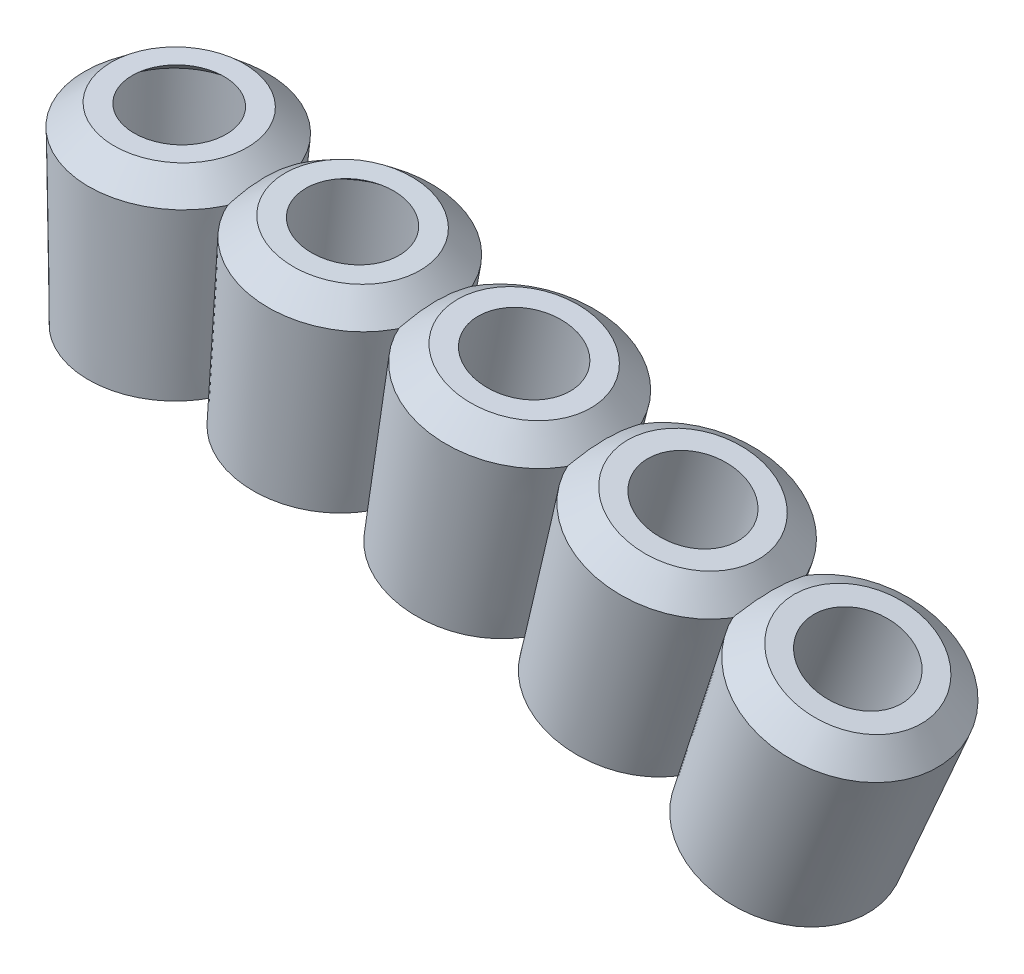
ISO-10303-21;
HEADER;
FILE_DESCRIPTION(('STEP AP214'),'2;1');
FILE_NAME('part.step','',(''),(''),'','','');
FILE_SCHEMA(('AUTOMOTIVE_DESIGN { 1 0 10303 214 1 1 1 1 }'));
ENDSEC;
DATA;
#1=APPLICATION_CONTEXT('core data for automotive mechanical design processes');
#2=APPLICATION_PROTOCOL_DEFINITION('international standard','automotive_design',2000,#1);
#3=PRODUCT_CONTEXT('',#1,'mechanical');
#4=PRODUCT('Part','Part','',(#3));
#5=PRODUCT_RELATED_PRODUCT_CATEGORY('part','',(#4));
#6=PRODUCT_DEFINITION_FORMATION('','',#4);
#7=PRODUCT_DEFINITION_CONTEXT('part definition',#1,'design');
#8=PRODUCT_DEFINITION('design','',#6,#7);
#9=PRODUCT_DEFINITION_SHAPE('','',#8);
#10=(LENGTH_UNIT() NAMED_UNIT(*) SI_UNIT(.MILLI.,.METRE.));
#11=(NAMED_UNIT(*) PLANE_ANGLE_UNIT() SI_UNIT($,.RADIAN.));
#12=(NAMED_UNIT(*) SI_UNIT($,.STERADIAN.) SOLID_ANGLE_UNIT());
#13=UNCERTAINTY_MEASURE_WITH_UNIT(LENGTH_MEASURE(1.E-05),#10,'distance_accuracy_value','');
#14=(GEOMETRIC_REPRESENTATION_CONTEXT(3) GLOBAL_UNCERTAINTY_ASSIGNED_CONTEXT((#13)) GLOBAL_UNIT_ASSIGNED_CONTEXT((#10,
#11,#12)) REPRESENTATION_CONTEXT('',''));
#15=CARTESIAN_POINT('',(0.,0.,0.));
#16=DIRECTION('',(0.,0.,1.));
#17=DIRECTION('',(1.,0.,0.));
#18=AXIS2_PLACEMENT_3D('',#15,#16,#17);
#19=CARTESIAN_POINT('',(17.6763460690378,53.1370566520918,6.92820323027551));
#20=DIRECTION('',(-0.356737999319626,-0.93420447432103,0.));
#21=DIRECTION('',(0.93420447432103,-0.356737999319626,0.));
#22=AXIS2_PLACEMENT_3D('',#19,#20,#21);
#23=PLANE('',#22);
#24=CARTESIAN_POINT('',(19.9583139722928,52.2656578451974,6.92820323027551));
#25=DIRECTION('',(0.356737999319626,0.93420447432103,0.));
#26=DIRECTION('',(-0.93420447432103,0.356737999319626,0.));
#27=AXIS2_PLACEMENT_3D('',#24,#25,#26);
#28=CIRCLE('',#27,2.03);
#29=CARTESIAN_POINT('',(18.0618788894211,52.9898359838162,6.92820323027551));
#30=VERTEX_POINT('',#29);
#31=EDGE_CURVE('E11',#30,#30,#28,.T.);
#32=ORIENTED_EDGE('',*,*,#31,.T.);
#33=EDGE_LOOP('',(#32));
#34=FACE_BOUND('',#33,.T.);
#35=CARTESIAN_POINT('',(19.9583139722928,52.2656578451974,6.92820323027551));
#36=DIRECTION('',(0.356737999319626,0.93420447432103,0.));
#37=DIRECTION('',(-0.93420447432103,0.356737999319626,0.));
#38=AXIS2_PLACEMENT_3D('',#35,#36,#37);
#39=CIRCLE('',#38,2.44268569245881);
#40=CARTESIAN_POINT('',(17.6763460690378,53.1370566520918,6.92820323027551));
#41=VERTEX_POINT('',#40);
#42=EDGE_CURVE('E70',#41,#41,#39,.T.);
#43=ORIENTED_EDGE('',*,*,#42,.F.);
#44=EDGE_LOOP('',(#43));
#45=FACE_BOUND('',#44,.T.);
#46=ADVANCED_FACE('F48',(#34,#45),#23,.T.);
#47=CARTESIAN_POINT('',(22.139160237776,57.9767296763631,6.92820323027551));
#48=DIRECTION('',(0.356737999319626,0.93420447432103,0.));
#49=DIRECTION('',(-0.93420447432103,0.356737999319626,0.));
#50=AXIS2_PLACEMENT_3D('',#47,#48,#49);
#51=CYLINDRICAL_SURFACE('',#50,2.03);
#52=CARTESIAN_POINT('',(21.7443333910477,56.9427803704324,6.92820323027551));
#53=DIRECTION('',(0.356737999319626,0.93420447432103,0.));
#54=DIRECTION('',(-0.93420447432103,0.356737999319626,0.));
#55=AXIS2_PLACEMENT_3D('',#52,#53,#54);
#56=CIRCLE('',#55,2.03);
#57=CARTESIAN_POINT('',(19.847898308176,57.6669585090513,6.92820323027551));
#58=VERTEX_POINT('',#57);
#59=EDGE_CURVE('E54',#58,#58,#56,.T.);
#60=ORIENTED_EDGE('',*,*,#59,.T.);
#61=EDGE_LOOP('',(#60));
#62=FACE_BOUND('',#61,.T.);
#63=ORIENTED_EDGE('',*,*,#31,.F.);
#64=EDGE_LOOP('',(#63));
#65=FACE_BOUND('',#64,.T.);
#66=ADVANCED_FACE('F78',(#62,#65),#51,.F.);
#67=CARTESIAN_POINT('',(21.7443333910477,56.9427803704324,6.92820323027551));
#68=DIRECTION('',(-0.356737999319626,-0.93420447432103,0.));
#69=DIRECTION('',(0.93420447432103,-0.356737999319626,0.));
#70=AXIS2_PLACEMENT_3D('',#67,#68,#69);
#71=CONICAL_SURFACE('',#70,2.03,0.853665591888528);
#72=CARTESIAN_POINT('',(21.9607912381162,57.5096274392026,6.92820323027551));
#73=DIRECTION('',(0.356737999319626,0.93420447432103,0.));
#74=DIRECTION('',(-0.93420447432103,0.356737999319626,0.));
#75=AXIS2_PLACEMENT_3D('',#72,#73,#74);
#76=CIRCLE('',#75,1.33416640641263);
#77=CARTESIAN_POINT('',(20.7144070117567,57.9855752937857,6.92820323027551));
#78=VERTEX_POINT('',#77);
#79=EDGE_CURVE('E58',#78,#78,#76,.T.);
#80=ORIENTED_EDGE('',*,*,#79,.T.);
#81=EDGE_LOOP('',(#80));
#82=FACE_BOUND('',#81,.T.);
#83=ORIENTED_EDGE('',*,*,#59,.F.);
#84=EDGE_LOOP('',(#83));
#85=FACE_BOUND('',#84,.T.);
#86=ADVANCED_FACE('F82',(#82,#85),#71,.F.);
#87=CARTESIAN_POINT('',(20.7144070117567,57.9855752937857,6.92820323027551));
#88=DIRECTION('',(0.356737999319626,0.93420447432103,0.));
#89=DIRECTION('',(-0.93420447432103,0.356737999319626,0.));
#90=AXIS2_PLACEMENT_3D('',#87,#88,#89);
#91=PLANE('',#90);
#92=CARTESIAN_POINT('',(21.9607912381162,57.5096274392026,6.92820323027551));
#93=DIRECTION('',(0.356737999319626,0.93420447432103,0.));
#94=DIRECTION('',(-0.93420447432103,0.356737999319626,0.));
#95=AXIS2_PLACEMENT_3D('',#92,#93,#94);
#96=CIRCLE('',#95,1.9326932091133);
#97=CARTESIAN_POINT('',(20.1552605946727,58.1990925479203,6.92820323027551));
#98=VERTEX_POINT('',#97);
#99=EDGE_CURVE('E62',#98,#98,#96,.T.);
#100=ORIENTED_EDGE('',*,*,#99,.T.);
#101=EDGE_LOOP('',(#100));
#102=FACE_BOUND('',#101,.T.);
#103=ORIENTED_EDGE('',*,*,#79,.F.);
#104=EDGE_LOOP('',(#103));
#105=FACE_BOUND('',#104,.T.);
#106=ADVANCED_FACE('F86',(#102,#105),#91,.T.);
#107=CARTESIAN_POINT('',(21.9607912381162,57.5096274392026,6.92820323027551));
#108=DIRECTION('',(-0.356737999319626,-0.93420447432103,0.));
#109=DIRECTION('',(0.93420447432103,-0.356737999319626,0.));
#110=AXIS2_PLACEMENT_3D('',#107,#108,#109);
#111=CONICAL_SURFACE('',#110,1.9326932091133,0.853665591888487);
#112=CARTESIAN_POINT('',(21.7345196561508,56.9170807391401,6.92820323027551));
#113=DIRECTION('',(0.356737999319626,0.93420447432103,0.));
#114=DIRECTION('',(-0.93420447432103,0.356737999319626,0.));
#115=AXIS2_PLACEMENT_3D('',#112,#113,#114);
#116=CIRCLE('',#115,2.66007440659806);
#117=CARTESIAN_POINT('',(19.2494662434801,57.8660303609913,6.92820323027551));
#118=VERTEX_POINT('',#117);
#119=EDGE_CURVE('E67',#118,#118,#116,.T.);
#120=ORIENTED_EDGE('',*,*,#119,.T.);
#121=EDGE_LOOP('',(#120));
#122=FACE_BOUND('',#121,.T.);
#123=ORIENTED_EDGE('',*,*,#99,.F.);
#124=EDGE_LOOP('',(#123));
#125=FACE_BOUND('',#124,.T.);
#126=ADVANCED_FACE('F93',(#122,#125),#111,.T.);
#127=CARTESIAN_POINT('',(21.7345196561508,56.9170807391401,6.92820323027551));
#128=DIRECTION('',(0.356737999319626,0.93420447432103,0.));
#129=DIRECTION('',(-0.93420447432103,0.356737999319626,0.));
#130=AXIS2_PLACEMENT_3D('',#127,#128,#129);
#131=CONICAL_SURFACE('',#130,2.66007440659806,0.0436332312998581);
#132=ORIENTED_EDGE('',*,*,#42,.T.);
#133=EDGE_LOOP('',(#132));
#134=FACE_BOUND('',#133,.T.);
#135=ORIENTED_EDGE('',*,*,#119,.F.);
#136=EDGE_LOOP('',(#135));
#137=FACE_BOUND('',#136,.T.);
#138=ADVANCED_FACE('F74',(#134,#137),#131,.T.);
#139=CLOSED_SHELL('',(#46,#66,#86,#106,#126,#138));
#140=MANIFOLD_SOLID_BREP('B2',#139);
#141=CARTESIAN_POINT('',(13.3578736244006,54.3835196749396,6.92820323027551));
#142=DIRECTION('',(-0.280666708920788,-0.959805291975187,0.));
#143=DIRECTION('',(0.959805291975187,-0.280666708920788,0.));
#144=AXIS2_PLACEMENT_3D('',#141,#142,#143);
#145=PLANE('',#144);
#146=CARTESIAN_POINT('',(15.7023762786546,53.6979391207093,6.92820323027551));
#147=DIRECTION('',(0.280666708920788,0.959805291975187,0.));
#148=DIRECTION('',(-0.959805291975187,0.280666708920788,0.));
#149=AXIS2_PLACEMENT_3D('',#146,#147,#148);
#150=CIRCLE('',#149,2.03);
#151=CARTESIAN_POINT('',(13.753971535945,54.2676925398185,6.92820323027551));
#152=VERTEX_POINT('',#151);
#153=EDGE_CURVE('E47',#152,#152,#150,.T.);
#154=ORIENTED_EDGE('',*,*,#153,.T.);
#155=EDGE_LOOP('',(#154));
#156=FACE_BOUND('',#155,.T.);
#157=CARTESIAN_POINT('',(15.7023762786546,53.6979391207093,6.92820323027551));
#158=DIRECTION('',(0.280666708920788,0.959805291975187,0.));
#159=DIRECTION('',(-0.959805291975187,0.280666708920788,0.));
#160=AXIS2_PLACEMENT_3D('',#157,#158,#159);
#161=CIRCLE('',#160,2.44268569245881);
#162=CARTESIAN_POINT('',(13.3578736244006,54.3835196749396,6.92820323027551));
#163=VERTEX_POINT('',#162);
#164=EDGE_CURVE('E170',#163,#163,#161,.T.);
#165=ORIENTED_EDGE('',*,*,#164,.F.);
#166=EDGE_LOOP('',(#165));
#167=FACE_BOUND('',#166,.T.);
#168=ADVANCED_FACE('F148',(#156,#167),#145,.T.);
#169=CARTESIAN_POINT('',(17.4181759556241,59.5655164199801,6.92820323027551));
#170=DIRECTION('',(0.280666708920788,0.959805291975187,0.));
#171=DIRECTION('',(-0.959805291975187,0.280666708920788,0.));
#172=AXIS2_PLACEMENT_3D('',#169,#170,#171);
#173=CYLINDRICAL_SURFACE('',#172,2.03);
#174=CARTESIAN_POINT('',(17.1075425163041,58.5032329020302,6.92820323027551));
#175=DIRECTION('',(0.280666708920788,0.959805291975187,0.));
#176=DIRECTION('',(-0.959805291975187,0.280666708920788,0.));
#177=AXIS2_PLACEMENT_3D('',#174,#175,#176);
#178=CIRCLE('',#177,2.03);
#179=CARTESIAN_POINT('',(15.1591377735945,59.0729863211394,6.92820323027551));
#180=VERTEX_POINT('',#179);
#181=EDGE_CURVE('E154',#180,#180,#178,.T.);
#182=ORIENTED_EDGE('',*,*,#181,.T.);
#183=EDGE_LOOP('',(#182));
#184=FACE_BOUND('',#183,.T.);
#185=ORIENTED_EDGE('',*,*,#153,.F.);
#186=EDGE_LOOP('',(#185));
#187=FACE_BOUND('',#186,.T.);
#188=ADVANCED_FACE('F178',(#184,#187),#173,.F.);
#189=CARTESIAN_POINT('',(17.1075425163041,58.5032329020302,6.92820323027551));
#190=DIRECTION('',(-0.280666708920788,-0.959805291975187,0.));
#191=DIRECTION('',(0.959805291975187,-0.280666708920788,0.));
#192=AXIS2_PLACEMENT_3D('',#189,#190,#191);
#193=CONICAL_SURFACE('',#192,2.03,0.853665591888528);
#194=CARTESIAN_POINT('',(17.2778426011637,59.0856137739925,6.92820323027551));
#195=DIRECTION('',(0.280666708920788,0.959805291975187,0.));
#196=DIRECTION('',(-0.959805291975187,0.280666708920788,0.));
#197=AXIS2_PLACEMENT_3D('',#194,#195,#196);
#198=CIRCLE('',#197,1.33416640641263);
#199=CARTESIAN_POINT('',(15.9973026239134,59.460069868433,6.92820323027551));
#200=VERTEX_POINT('',#199);
#201=EDGE_CURVE('E158',#200,#200,#198,.T.);
#202=ORIENTED_EDGE('',*,*,#201,.T.);
#203=EDGE_LOOP('',(#202));
#204=FACE_BOUND('',#203,.T.);
#205=ORIENTED_EDGE('',*,*,#181,.F.);
#206=EDGE_LOOP('',(#205));
#207=FACE_BOUND('',#206,.T.);
#208=ADVANCED_FACE('F182',(#204,#207),#193,.F.);
#209=CARTESIAN_POINT('',(15.9973026239134,59.460069868433,6.92820323027551));
#210=DIRECTION('',(0.280666708920788,0.959805291975187,0.));
#211=DIRECTION('',(-0.959805291975187,0.280666708920788,0.));
#212=AXIS2_PLACEMENT_3D('',#209,#210,#211);
#213=PLANE('',#212);
#214=CARTESIAN_POINT('',(17.2778426011637,59.0856137739925,6.92820323027551));
#215=DIRECTION('',(0.280666708920788,0.959805291975187,0.));
#216=DIRECTION('',(-0.959805291975187,0.280666708920788,0.));
#217=AXIS2_PLACEMENT_3D('',#214,#215,#216);
#218=CIRCLE('',#217,1.9326932091133);
#219=CARTESIAN_POINT('',(15.4228334312923,59.6280564163479,6.92820323027551));
#220=VERTEX_POINT('',#219);
#221=EDGE_CURVE('E162',#220,#220,#218,.T.);
#222=ORIENTED_EDGE('',*,*,#221,.T.);
#223=EDGE_LOOP('',(#222));
#224=FACE_BOUND('',#223,.T.);
#225=ORIENTED_EDGE('',*,*,#201,.F.);
#226=EDGE_LOOP('',(#225));
#227=FACE_BOUND('',#226,.T.);
#228=ADVANCED_FACE('F186',(#224,#227),#213,.T.);
#229=CARTESIAN_POINT('',(17.2778426011637,59.0856137739925,6.92820323027551));
#230=DIRECTION('',(-0.280666708920788,-0.959805291975187,0.));
#231=DIRECTION('',(0.959805291975187,-0.280666708920788,0.));
#232=AXIS2_PLACEMENT_3D('',#229,#230,#231);
#233=CONICAL_SURFACE('',#232,1.9326932091133,0.853665591888487);
#234=CARTESIAN_POINT('',(17.0998214754254,58.4768290013915,6.92820323027551));
#235=DIRECTION('',(0.280666708920788,0.959805291975187,0.));
#236=DIRECTION('',(-0.959805291975187,0.280666708920788,0.));
#237=AXIS2_PLACEMENT_3D('',#234,#235,#236);
#238=CIRCLE('',#237,2.66007440659806);
#239=CARTESIAN_POINT('',(14.5466679829248,59.2234233305758,6.92820323027551));
#240=VERTEX_POINT('',#239);
#241=EDGE_CURVE('E167',#240,#240,#238,.T.);
#242=ORIENTED_EDGE('',*,*,#241,.T.);
#243=EDGE_LOOP('',(#242));
#244=FACE_BOUND('',#243,.T.);
#245=ORIENTED_EDGE('',*,*,#221,.F.);
#246=EDGE_LOOP('',(#245));
#247=FACE_BOUND('',#246,.T.);
#248=ADVANCED_FACE('F193',(#244,#247),#233,.T.);
#249=CARTESIAN_POINT('',(17.0998214754254,58.4768290013915,6.92820323027551));
#250=DIRECTION('',(0.280666708920788,0.959805291975187,0.));
#251=DIRECTION('',(-0.959805291975187,0.280666708920788,0.));
#252=AXIS2_PLACEMENT_3D('',#249,#250,#251);
#253=CONICAL_SURFACE('',#252,2.66007440659806,0.0436332312998581);
#254=ORIENTED_EDGE('',*,*,#164,.T.);
#255=EDGE_LOOP('',(#254));
#256=FACE_BOUND('',#255,.T.);
#257=ORIENTED_EDGE('',*,*,#241,.F.);
#258=EDGE_LOOP('',(#257));
#259=FACE_BOUND('',#258,.T.);
#260=ADVANCED_FACE('F174',(#256,#259),#253,.T.);
#261=CLOSED_SHELL('',(#168,#188,#208,#228,#248,#260));
#262=MANIFOLD_SOLID_BREP('B6',#261);
#263=CARTESIAN_POINT('',(8.95334651074277,55.2796308440873,6.92820323027551));
#264=DIRECTION('',(-0.202787295356513,-0.979222810621766,0.));
#265=DIRECTION('',(0.979222810621766,-0.202787295356513,0.));
#266=AXIS2_PLACEMENT_3D('',#263,#264,#265);
#267=PLANE('',#266);
#268=CARTESIAN_POINT('',(11.3452800599779,54.7842852191075,6.92820323027551));
#269=DIRECTION('',(0.202787295356513,0.979222810621766,0.));
#270=DIRECTION('',(-0.979222810621766,0.202787295356513,0.));
#271=AXIS2_PLACEMENT_3D('',#268,#269,#270);
#272=CIRCLE('',#271,2.03);
#273=CARTESIAN_POINT('',(9.35745775441567,55.1959434286813,6.92820323027551));
#274=VERTEX_POINT('',#273);
#275=EDGE_CURVE('E147',#274,#274,#272,.T.);
#276=ORIENTED_EDGE('',*,*,#275,.T.);
#277=EDGE_LOOP('',(#276));
#278=FACE_BOUND('',#277,.T.);
#279=CARTESIAN_POINT('',(11.3452800599779,54.7842852191075,6.92820323027551));
#280=DIRECTION('',(0.202787295356513,0.979222810621766,0.));
#281=DIRECTION('',(-0.979222810621766,0.202787295356513,0.));
#282=AXIS2_PLACEMENT_3D('',#279,#280,#281);
#283=CIRCLE('',#282,2.44268569245881);
#284=CARTESIAN_POINT('',(8.95334651074277,55.2796308440873,6.92820323027551));
#285=VERTEX_POINT('',#284);
#286=EDGE_CURVE('E270',#285,#285,#283,.T.);
#287=ORIENTED_EDGE('',*,*,#286,.F.);
#288=EDGE_LOOP('',(#287));
#289=FACE_BOUND('',#288,.T.);
#290=ADVANCED_FACE('F248',(#278,#289),#267,.T.);
#291=CARTESIAN_POINT('',(12.5849795498252,60.7705676271868,6.92820323027551));
#292=DIRECTION('',(0.202787295356513,0.979222810621766,0.));
#293=DIRECTION('',(-0.979222810621766,0.202787295356513,0.));
#294=AXIS2_PLACEMENT_3D('',#291,#292,#293);
#295=CYLINDRICAL_SURFACE('',#294,2.03);
#296=CARTESIAN_POINT('',(12.3605406940406,59.6867933858681,6.92820323027551));
#297=DIRECTION('',(0.202787295356513,0.979222810621766,0.));
#298=DIRECTION('',(-0.979222810621766,0.202787295356513,0.));
#299=AXIS2_PLACEMENT_3D('',#296,#297,#298);
#300=CIRCLE('',#299,2.03);
#301=CARTESIAN_POINT('',(10.3727183884784,60.0984515954418,6.92820323027551));
#302=VERTEX_POINT('',#301);
#303=EDGE_CURVE('E254',#302,#302,#300,.T.);
#304=ORIENTED_EDGE('',*,*,#303,.T.);
#305=EDGE_LOOP('',(#304));
#306=FACE_BOUND('',#305,.T.);
#307=ORIENTED_EDGE('',*,*,#275,.F.);
#308=EDGE_LOOP('',(#307));
#309=FACE_BOUND('',#308,.T.);
#310=ADVANCED_FACE('F278',(#306,#309),#295,.F.);
#311=CARTESIAN_POINT('',(12.3605406940406,59.6867933858681,6.92820323027551));
#312=DIRECTION('',(-0.202787295356513,-0.979222810621766,0.));
#313=DIRECTION('',(0.979222810621766,-0.202787295356513,0.));
#314=AXIS2_PLACEMENT_3D('',#311,#312,#313);
#315=CONICAL_SURFACE('',#314,2.03,0.853665591888528);
#316=CARTESIAN_POINT('',(12.4835859021469,60.2809562218759,6.92820323027551));
#317=DIRECTION('',(0.202787295356513,0.979222810621766,0.));
#318=DIRECTION('',(-0.979222810621766,0.202787295356513,0.));
#319=AXIS2_PLACEMENT_3D('',#316,#317,#318);
#320=CIRCLE('',#319,1.33416640641263);
#321=CARTESIAN_POINT('',(11.1771397238224,60.5515082189878,6.92820323027551));
#322=VERTEX_POINT('',#321);
#323=EDGE_CURVE('E258',#322,#322,#320,.T.);
#324=ORIENTED_EDGE('',*,*,#323,.T.);
#325=EDGE_LOOP('',(#324));
#326=FACE_BOUND('',#325,.T.);
#327=ORIENTED_EDGE('',*,*,#303,.F.);
#328=EDGE_LOOP('',(#327));
#329=FACE_BOUND('',#328,.T.);
#330=ADVANCED_FACE('F282',(#326,#329),#315,.F.);
#331=CARTESIAN_POINT('',(11.1771397238224,60.5515082189878,6.92820323027551));
#332=DIRECTION('',(0.202787295356513,0.979222810621766,0.));
#333=DIRECTION('',(-0.979222810621766,0.202787295356513,0.));
#334=AXIS2_PLACEMENT_3D('',#331,#332,#333);
#335=PLANE('',#334);
#336=CARTESIAN_POINT('',(12.4835859021469,60.2809562218759,6.92820323027551));
#337=DIRECTION('',(0.202787295356513,0.979222810621766,0.));
#338=DIRECTION('',(-0.979222810621766,0.202787295356513,0.));
#339=AXIS2_PLACEMENT_3D('',#336,#337,#338);
#340=CIRCLE('',#339,1.9326932091133);
#341=CARTESIAN_POINT('',(10.5910486258494,60.6728818505059,6.92820323027551));
#342=VERTEX_POINT('',#341);
#343=EDGE_CURVE('E262',#342,#342,#340,.T.);
#344=ORIENTED_EDGE('',*,*,#343,.T.);
#345=EDGE_LOOP('',(#344));
#346=FACE_BOUND('',#345,.T.);
#347=ORIENTED_EDGE('',*,*,#323,.F.);
#348=EDGE_LOOP('',(#347));
#349=FACE_BOUND('',#348,.T.);
#350=ADVANCED_FACE('F286',(#346,#349),#335,.T.);
#351=CARTESIAN_POINT('',(12.4835859021469,60.2809562218759,6.92820323027551));
#352=DIRECTION('',(-0.202787295356513,-0.979222810621766,0.));
#353=DIRECTION('',(0.979222810621766,-0.202787295356513,0.));
#354=AXIS2_PLACEMENT_3D('',#351,#352,#353);
#355=CONICAL_SURFACE('',#354,1.9326932091133,0.853665591888487);
#356=CARTESIAN_POINT('',(12.3549620880024,59.6598553162294,6.92820323027551));
#357=DIRECTION('',(0.202787295356513,0.979222810621766,0.));
#358=DIRECTION('',(-0.979222810621766,0.202787295356513,0.));
#359=AXIS2_PLACEMENT_3D('',#356,#357,#358);
#360=CIRCLE('',#359,2.66007440659806);
#361=CARTESIAN_POINT('',(9.75015655111038,60.1992846105905,6.92820323027551));
#362=VERTEX_POINT('',#361);
#363=EDGE_CURVE('E267',#362,#362,#360,.T.);
#364=ORIENTED_EDGE('',*,*,#363,.T.);
#365=EDGE_LOOP('',(#364));
#366=FACE_BOUND('',#365,.T.);
#367=ORIENTED_EDGE('',*,*,#343,.F.);
#368=EDGE_LOOP('',(#367));
#369=FACE_BOUND('',#368,.T.);
#370=ADVANCED_FACE('F293',(#366,#369),#355,.T.);
#371=CARTESIAN_POINT('',(12.3549620880024,59.6598553162294,6.92820323027551));
#372=DIRECTION('',(0.202787295356513,0.979222810621766,0.));
#373=DIRECTION('',(-0.979222810621766,0.202787295356513,0.));
#374=AXIS2_PLACEMENT_3D('',#371,#372,#373);
#375=CONICAL_SURFACE('',#374,2.66007440659806,0.0436332312998581);
#376=ORIENTED_EDGE('',*,*,#286,.T.);
#377=EDGE_LOOP('',(#376));
#378=FACE_BOUND('',#377,.T.);
#379=ORIENTED_EDGE('',*,*,#363,.F.);
#380=EDGE_LOOP('',(#379));
#381=FACE_BOUND('',#380,.T.);
#382=ADVANCED_FACE('F274',(#378,#381),#375,.T.);
#383=CLOSED_SHELL('',(#290,#310,#330,#350,#370,#382));
#384=MANIFOLD_SOLID_BREP('B42',#383);
#385=CARTESIAN_POINT('',(4.49113976241611,55.8196171935498,6.92820323027551));
#386=DIRECTION('',(-0.123601476740493,-0.992331937885489,0.));
#387=DIRECTION('',(0.992331937885489,-0.123601476740493,0.));
#388=AXIS2_PLACEMENT_3D('',#385,#386,#387);
#389=PLANE('',#388);
#390=CARTESIAN_POINT('',(6.91509478925891,55.517697634749,6.92820323027551));
#391=DIRECTION('',(0.123601476740493,0.992331937885489,0.));
#392=DIRECTION('',(-0.992331937885489,0.123601476740493,0.));
#393=AXIS2_PLACEMENT_3D('',#390,#391,#392);
#394=CIRCLE('',#393,2.03);
#395=CARTESIAN_POINT('',(4.90066095535137,55.7686086325323,6.92820323027551));
#396=VERTEX_POINT('',#395);
#397=EDGE_CURVE('E247',#396,#396,#394,.T.);
#398=ORIENTED_EDGE('',*,*,#397,.T.);
#399=EDGE_LOOP('',(#398));
#400=FACE_BOUND('',#399,.T.);
#401=CARTESIAN_POINT('',(6.91509478925891,55.517697634749,6.92820323027551));
#402=DIRECTION('',(0.123601476740493,0.992331937885489,0.));
#403=DIRECTION('',(-0.992331937885489,0.123601476740493,0.));
#404=AXIS2_PLACEMENT_3D('',#401,#402,#403);
#405=CIRCLE('',#404,2.44268569245881);
#406=CARTESIAN_POINT('',(4.49113976241611,55.8196171935498,6.92820323027551));
#407=VERTEX_POINT('',#406);
#408=EDGE_CURVE('E369',#407,#407,#405,.T.);
#409=ORIENTED_EDGE('',*,*,#408,.F.);
#410=EDGE_LOOP('',(#409));
#411=FACE_BOUND('',#410,.T.);
#412=ADVANCED_FACE('F347',(#400,#411),#389,.T.);
#413=CARTESIAN_POINT('',(7.67070764651498,61.5841200651734,6.92820323027551));
#414=DIRECTION('',(0.123601476740493,0.992331937885489,0.));
#415=DIRECTION('',(-0.992331937885489,0.123601476740493,0.));
#416=AXIS2_PLACEMENT_3D('',#413,#414,#415);
#417=CYLINDRICAL_SURFACE('',#416,2.03);
#418=CARTESIAN_POINT('',(7.53390926393314,60.4858370376005,6.92820323027551));
#419=DIRECTION('',(0.123601476740493,0.992331937885489,0.));
#420=DIRECTION('',(-0.992331937885489,0.123601476740493,0.));
#421=AXIS2_PLACEMENT_3D('',#418,#419,#420);
#422=CIRCLE('',#421,2.03);
#423=CARTESIAN_POINT('',(5.51947543002559,60.7367480353837,6.92820323027551));
#424=VERTEX_POINT('',#423);
#425=EDGE_CURVE('E353',#424,#424,#422,.T.);
#426=ORIENTED_EDGE('',*,*,#425,.T.);
#427=EDGE_LOOP('',(#426));
#428=FACE_BOUND('',#427,.T.);
#429=ORIENTED_EDGE('',*,*,#397,.F.);
#430=EDGE_LOOP('',(#429));
#431=FACE_BOUND('',#430,.T.);
#432=ADVANCED_FACE('F377',(#428,#431),#417,.F.);
#433=CARTESIAN_POINT('',(7.53390926393314,60.4858370376005,6.92820323027551));
#434=DIRECTION('',(-0.123601476740493,-0.992331937885489,0.));
#435=DIRECTION('',(0.992331937885489,-0.123601476740493,0.));
#436=AXIS2_PLACEMENT_3D('',#433,#434,#435);
#437=CONICAL_SURFACE('',#436,2.03,0.853665591888528);
#438=CARTESIAN_POINT('',(7.60890690814473,61.0879540962307,6.92820323027551));
#439=DIRECTION('',(0.123601476740493,0.992331937885489,0.));
#440=DIRECTION('',(-0.992331937885489,0.123601476740493,0.));
#441=AXIS2_PLACEMENT_3D('',#438,#439,#440);
#442=CIRCLE('',#441,1.33416640641263);
#443=CARTESIAN_POINT('',(6.28497097260757,61.2528590342808,6.92820323027551));
#444=VERTEX_POINT('',#443);
#445=EDGE_CURVE('E357',#444,#444,#442,.T.);
#446=ORIENTED_EDGE('',*,*,#445,.T.);
#447=EDGE_LOOP('',(#446));
#448=FACE_BOUND('',#447,.T.);
#449=ORIENTED_EDGE('',*,*,#425,.F.);
#450=EDGE_LOOP('',(#449));
#451=FACE_BOUND('',#450,.T.);
#452=ADVANCED_FACE('F381',(#448,#451),#437,.F.);
#453=CARTESIAN_POINT('',(6.28497097260757,61.2528590342809,6.92820323027551));
#454=DIRECTION('',(0.123601476740493,0.992331937885489,0.));
#455=DIRECTION('',(-0.992331937885489,0.123601476740493,0.));
#456=AXIS2_PLACEMENT_3D('',#453,#454,#455);
#457=PLANE('',#456);
#458=CARTESIAN_POINT('',(7.60890690814473,61.0879540962307,6.92820323027551));
#459=DIRECTION('',(0.123601476740493,0.992331937885489,0.));
#460=DIRECTION('',(-0.992331937885489,0.123601476740493,0.));
#461=AXIS2_PLACEMENT_3D('',#458,#459,#460);
#462=CIRCLE('',#461,1.9326932091133);
#463=CARTESIAN_POINT('',(5.69103371060721,61.3268378309634,6.92820323027551));
#464=VERTEX_POINT('',#463);
#465=EDGE_CURVE('E361',#464,#464,#462,.T.);
#466=ORIENTED_EDGE('',*,*,#465,.T.);
#467=EDGE_LOOP('',(#466));
#468=FACE_BOUND('',#467,.T.);
#469=ORIENTED_EDGE('',*,*,#445,.F.);
#470=EDGE_LOOP('',(#469));
#471=FACE_BOUND('',#470,.T.);
#472=ADVANCED_FACE('F385',(#468,#471),#457,.T.);
#473=CARTESIAN_POINT('',(7.60890690814473,61.0879540962307,6.92820323027551));
#474=DIRECTION('',(-0.123601476740493,-0.992331937885489,0.));
#475=DIRECTION('',(0.992331937885489,-0.123601476740493,0.));
#476=AXIS2_PLACEMENT_3D('',#473,#474,#475);
#477=CONICAL_SURFACE('',#476,1.9326932091133,0.853665591888487);
#478=CARTESIAN_POINT('',(7.53050903147148,60.4585383405548,6.92820323027551));
#479=DIRECTION('',(0.123601476740493,0.992331937885489,0.));
#480=DIRECTION('',(-0.992331937885489,0.123601476740493,0.));
#481=AXIS2_PLACEMENT_3D('',#478,#479,#480);
#482=CIRCLE('',#481,2.66007440659806);
#483=CARTESIAN_POINT('',(4.89083224065244,60.7873274654499,6.92820323027551));
#484=VERTEX_POINT('',#483);
#485=EDGE_CURVE('E366',#484,#484,#482,.T.);
#486=ORIENTED_EDGE('',*,*,#485,.T.);
#487=EDGE_LOOP('',(#486));
#488=FACE_BOUND('',#487,.T.);
#489=ORIENTED_EDGE('',*,*,#465,.F.);
#490=EDGE_LOOP('',(#489));
#491=FACE_BOUND('',#490,.T.);
#492=ADVANCED_FACE('F392',(#488,#491),#477,.T.);
#493=CARTESIAN_POINT('',(7.53050903147148,60.4585383405548,6.92820323027551));
#494=DIRECTION('',(0.123601476740493,0.992331937885489,0.));
#495=DIRECTION('',(-0.992331937885489,0.123601476740493,0.));
#496=AXIS2_PLACEMENT_3D('',#493,#494,#495);
#497=CONICAL_SURFACE('',#496,2.66007440659806,0.0436332312998581);
#498=ORIENTED_EDGE('',*,*,#408,.T.);
#499=EDGE_LOOP('',(#498));
#500=FACE_BOUND('',#499,.T.);
#501=ORIENTED_EDGE('',*,*,#485,.F.);
#502=EDGE_LOOP('',(#501));
#503=FACE_BOUND('',#502,.T.);
#504=ADVANCED_FACE('F373',(#500,#503),#497,.T.);
#505=CLOSED_SHELL('',(#412,#432,#452,#472,#492,#504));
#506=MANIFOLD_SOLID_BREP('B142',#505);
#507=CARTESIAN_POINT('',(0.,56.,6.92820323027551));
#508=DIRECTION('',(-0.0436193873653358,-0.999048221581858,0.));
#509=DIRECTION('',(0.999048221581858,-0.0436193873653358,0.));
#510=AXIS2_PLACEMENT_3D('',#507,#508,#509);
#511=PLANE('',#510);
#512=CARTESIAN_POINT('',(2.44036079693442,55.8934515465689,6.92820323027551));
#513=DIRECTION('',(0.0436193873653358,0.999048221581858,0.));
#514=DIRECTION('',(-0.999048221581858,0.0436193873653358,0.));
#515=AXIS2_PLACEMENT_3D('',#512,#513,#514);
#516=CIRCLE('',#515,2.03);
#517=CARTESIAN_POINT('',(0.412292907123247,55.9819989029205,6.92820323027551));
#518=VERTEX_POINT('',#517);
#519=EDGE_CURVE('E346',#518,#518,#516,.T.);
#520=ORIENTED_EDGE('',*,*,#519,.T.);
#521=EDGE_LOOP('',(#520));
#522=FACE_BOUND('',#521,.T.);
#523=CARTESIAN_POINT('',(2.44036079693442,55.8934515465689,6.92820323027551));
#524=DIRECTION('',(0.0436193873653358,0.999048221581858,0.));
#525=DIRECTION('',(-0.999048221581858,0.0436193873653358,0.));
#526=AXIS2_PLACEMENT_3D('',#523,#524,#525);
#527=CIRCLE('',#526,2.44268569245881);
#528=CARTESIAN_POINT('',(0.,56.,6.92820323027551));
#529=VERTEX_POINT('',#528);
#530=EDGE_CURVE('E461',#529,#529,#527,.T.);
#531=ORIENTED_EDGE('',*,*,#530,.F.);
#532=EDGE_LOOP('',(#531));
#533=FACE_BOUND('',#532,.T.);
#534=ADVANCED_FACE('F439',(#522,#533),#511,.T.);
#535=CARTESIAN_POINT('',(2.70701917989274,62.0009326313701,6.92820323027551));
#536=DIRECTION('',(0.0436193873653358,0.999048221581858,0.));
#537=DIRECTION('',(-0.999048221581858,0.0436193873653358,0.));
#538=AXIS2_PLACEMENT_3D('',#535,#536,#537);
#539=CYLINDRICAL_SURFACE('',#538,2.03);
#540=CARTESIAN_POINT('',(2.65874255894818,60.8952162237854,6.92820323027551));
#541=DIRECTION('',(0.0436193873653358,0.999048221581858,0.));
#542=DIRECTION('',(-0.999048221581858,0.0436193873653358,0.));
#543=AXIS2_PLACEMENT_3D('',#540,#541,#542);
#544=CIRCLE('',#543,2.03);
#545=CARTESIAN_POINT('',(0.63067466913701,60.983763580137,6.92820323027551));
#546=VERTEX_POINT('',#545);
#547=EDGE_CURVE('E445',#546,#546,#544,.T.);
#548=ORIENTED_EDGE('',*,*,#547,.T.);
#549=EDGE_LOOP('',(#548));
#550=FACE_BOUND('',#549,.T.);
#551=ORIENTED_EDGE('',*,*,#519,.F.);
#552=EDGE_LOOP('',(#551));
#553=FACE_BOUND('',#552,.T.);
#554=ADVANCED_FACE('F469',(#550,#553),#539,.F.);
#555=CARTESIAN_POINT('',(2.65874255894818,60.8952162237854,6.92820323027551));
#556=DIRECTION('',(-0.0436193873653358,-0.999048221581858,0.));
#557=DIRECTION('',(0.999048221581858,-0.0436193873653358,0.));
#558=AXIS2_PLACEMENT_3D('',#555,#556,#557);
#559=CONICAL_SURFACE('',#558,2.03,0.853665591888528);
#560=CARTESIAN_POINT('',(2.68520948621008,61.5014085205792,6.92820323027551));
#561=DIRECTION('',(0.0436193873653358,0.999048221581858,0.));
#562=DIRECTION('',(-0.999048221581858,0.0436193873653358,0.));
#563=AXIS2_PLACEMENT_3D('',#560,#561,#562);
#564=CIRCLE('',#563,1.33416640641263);
#565=CARTESIAN_POINT('',(1.35231291058928,61.5596040418703,6.92820323027551));
#566=VERTEX_POINT('',#565);
#567=EDGE_CURVE('E449',#566,#566,#564,.T.);
#568=ORIENTED_EDGE('',*,*,#567,.T.);
#569=EDGE_LOOP('',(#568));
#570=FACE_BOUND('',#569,.T.);
#571=ORIENTED_EDGE('',*,*,#547,.F.);
#572=EDGE_LOOP('',(#571));
#573=FACE_BOUND('',#572,.T.);
#574=ADVANCED_FACE('F473',(#570,#573),#559,.F.);
#575=CARTESIAN_POINT('',(1.35231291058928,61.5596040418703,6.92820323027551));
#576=DIRECTION('',(0.0436193873653358,0.999048221581858,0.));
#577=DIRECTION('',(-0.999048221581858,0.0436193873653358,0.));
#578=AXIS2_PLACEMENT_3D('',#575,#576,#577);
#579=PLANE('',#578);
#580=CARTESIAN_POINT('',(2.68520948621008,61.5014085205792,6.92820323027551));
#581=DIRECTION('',(0.0436193873653358,0.999048221581858,0.));
#582=DIRECTION('',(-0.999048221581858,0.0436193873653358,0.));
#583=AXIS2_PLACEMENT_3D('',#580,#581,#582);
#584=CIRCLE('',#583,1.9326932091133);
#585=CARTESIAN_POINT('',(0.754355772782104,61.5857114143258,6.92820323027551));
#586=VERTEX_POINT('',#585);
#587=EDGE_CURVE('E453',#586,#586,#584,.T.);
#588=ORIENTED_EDGE('',*,*,#587,.T.);
#589=EDGE_LOOP('',(#588));
#590=FACE_BOUND('',#589,.T.);
#591=ORIENTED_EDGE('',*,*,#567,.F.);
#592=EDGE_LOOP('',(#591));
#593=FACE_BOUND('',#592,.T.);
#594=ADVANCED_FACE('F477',(#590,#593),#579,.T.);
#595=CARTESIAN_POINT('',(2.68520948621008,61.5014085205792,6.92820323027551));
#596=DIRECTION('',(-0.0436193873653358,-0.999048221581858,0.));
#597=DIRECTION('',(0.999048221581858,-0.0436193873653358,0.));
#598=AXIS2_PLACEMENT_3D('',#595,#596,#597);
#599=CONICAL_SURFACE('',#598,1.9326932091133,0.853665591888487);
#600=CARTESIAN_POINT('',(2.6575426051872,60.867732764175,6.92820323027551));
#601=DIRECTION('',(0.0436193873653358,0.999048221581858,0.));
#602=DIRECTION('',(-0.999048221581858,0.0436193873653358,0.));
#603=AXIS2_PLACEMENT_3D('',#600,#601,#602);
#604=CIRCLE('',#603,2.66007440659806);
#605=CARTESIAN_POINT('',(0.,60.983763580137,6.92820323027551));
#606=VERTEX_POINT('',#605);
#607=EDGE_CURVE('E458',#606,#606,#604,.T.);
#608=ORIENTED_EDGE('',*,*,#607,.T.);
#609=EDGE_LOOP('',(#608));
#610=FACE_BOUND('',#609,.T.);
#611=ORIENTED_EDGE('',*,*,#587,.F.);
#612=EDGE_LOOP('',(#611));
#613=FACE_BOUND('',#612,.T.);
#614=ADVANCED_FACE('F484',(#610,#613),#599,.T.);
#615=CARTESIAN_POINT('',(2.6575426051872,60.867732764175,6.92820323027551));
#616=DIRECTION('',(0.0436193873653358,0.999048221581858,0.));
#617=DIRECTION('',(-0.999048221581858,0.0436193873653358,0.));
#618=AXIS2_PLACEMENT_3D('',#615,#616,#617);
#619=CONICAL_SURFACE('',#618,2.66007440659806,0.0436332312998581);
#620=ORIENTED_EDGE('',*,*,#530,.T.);
#621=EDGE_LOOP('',(#620));
#622=FACE_BOUND('',#621,.T.);
#623=ORIENTED_EDGE('',*,*,#607,.F.);
#624=EDGE_LOOP('',(#623));
#625=FACE_BOUND('',#624,.T.);
#626=ADVANCED_FACE('F465',(#622,#625),#619,.T.);
#627=CLOSED_SHELL('',(#534,#554,#574,#594,#614,#626));
#628=MANIFOLD_SOLID_BREP('B242',#627);
#629=ADVANCED_BREP_SHAPE_REPRESENTATION('',(#18,#140,#262,#384,#506,#628),#14);
#630=SHAPE_DEFINITION_REPRESENTATION(#9,#629);
ENDSEC;
END-ISO-10303-21;
